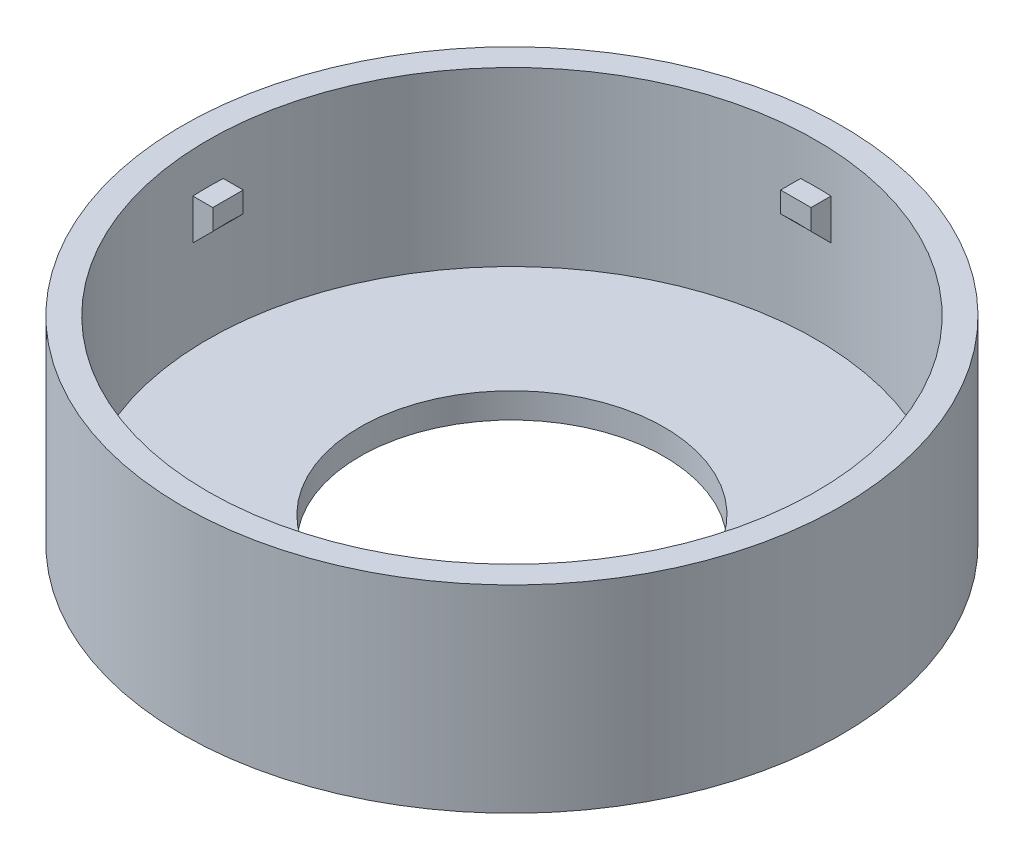
ISO-10303-21;
HEADER;
FILE_DESCRIPTION(('STEP AP214'),'2;1');
FILE_NAME('part.step','',(''),(''),'','','');
FILE_SCHEMA(('AUTOMOTIVE_DESIGN { 1 0 10303 214 1 1 1 1 }'));
ENDSEC;
DATA;
#1=APPLICATION_CONTEXT('core data for automotive mechanical design processes');
#2=APPLICATION_PROTOCOL_DEFINITION('international standard','automotive_design',2000,#1);
#3=PRODUCT_CONTEXT('',#1,'mechanical');
#4=PRODUCT('Part','Part','',(#3));
#5=PRODUCT_RELATED_PRODUCT_CATEGORY('part','',(#4));
#6=PRODUCT_DEFINITION_FORMATION('','',#4);
#7=PRODUCT_DEFINITION_CONTEXT('part definition',#1,'design');
#8=PRODUCT_DEFINITION('design','',#6,#7);
#9=PRODUCT_DEFINITION_SHAPE('','',#8);
#10=(LENGTH_UNIT() NAMED_UNIT(*) SI_UNIT(.MILLI.,.METRE.));
#11=(NAMED_UNIT(*) PLANE_ANGLE_UNIT() SI_UNIT($,.RADIAN.));
#12=(NAMED_UNIT(*) SI_UNIT($,.STERADIAN.) SOLID_ANGLE_UNIT());
#13=UNCERTAINTY_MEASURE_WITH_UNIT(LENGTH_MEASURE(1.E-05),#10,'distance_accuracy_value','');
#14=(GEOMETRIC_REPRESENTATION_CONTEXT(3) GLOBAL_UNCERTAINTY_ASSIGNED_CONTEXT((#13)) GLOBAL_UNIT_ASSIGNED_CONTEXT((#10,
#11,#12)) REPRESENTATION_CONTEXT('',''));
#15=CARTESIAN_POINT('',(0.,0.,0.));
#16=DIRECTION('',(0.,0.,1.));
#17=DIRECTION('',(1.,0.,0.));
#18=AXIS2_PLACEMENT_3D('',#15,#16,#17);
#19=CARTESIAN_POINT('',(0.,19.5,0.));
#20=DIRECTION('',(0.,-1.,0.));
#21=DIRECTION('',(0.,0.,-1.));
#22=AXIS2_PLACEMENT_3D('',#19,#20,#21);
#23=CYLINDRICAL_SURFACE('',#22,30.);
#24=CARTESIAN_POINT('',(0.,19.5,0.));
#25=DIRECTION('',(0.,1.,0.));
#26=DIRECTION('',(0.,0.,1.));
#27=AXIS2_PLACEMENT_3D('',#24,#25,#26);
#28=CIRCLE('',#27,30.);
#29=CARTESIAN_POINT('',(0.,19.5,30.));
#30=VERTEX_POINT('',#29);
#31=EDGE_CURVE('E257',#30,#30,#28,.T.);
#32=ORIENTED_EDGE('',*,*,#31,.T.);
#33=EDGE_LOOP('',(#32));
#34=FACE_BOUND('',#33,.T.);
#35=CARTESIAN_POINT('',(0.,2.5,0.));
#36=DIRECTION('',(0.,1.,0.));
#37=DIRECTION('',(0.,0.,1.));
#38=AXIS2_PLACEMENT_3D('',#35,#36,#37);
#39=CIRCLE('',#38,30.);
#40=CARTESIAN_POINT('',(0.,2.5,30.));
#41=VERTEX_POINT('',#40);
#42=EDGE_CURVE('E272',#41,#41,#39,.F.);
#43=ORIENTED_EDGE('',*,*,#42,.T.);
#44=EDGE_LOOP('',(#43));
#45=FACE_BOUND('',#44,.T.);
#46=CARTESIAN_POINT('',(0.,11.5,0.));
#47=DIRECTION('',(0.,1.,0.));
#48=DIRECTION('',(0.,0.,1.));
#49=AXIS2_PLACEMENT_3D('',#46,#47,#48);
#50=CIRCLE('',#49,30.);
#51=CARTESIAN_POINT('',(1.5,11.5,-29.9624765331573));
#52=VERTEX_POINT('',#51);
#53=CARTESIAN_POINT('',(-1.5,11.5,-29.9624765331573));
#54=VERTEX_POINT('',#53);
#55=EDGE_CURVE('E278',#52,#54,#50,.T.);
#56=ORIENTED_EDGE('',*,*,#55,.T.);
#57=DIRECTION('',(0.,1.,0.));
#58=VECTOR('',#57,1.);
#59=CARTESIAN_POINT('',(-1.5,13.5,-29.9624765331573));
#60=LINE('',#59,#58);
#61=CARTESIAN_POINT('',(-1.5,15.5,-29.9624765331573));
#62=VERTEX_POINT('',#61);
#63=EDGE_CURVE('E260',#54,#62,#60,.T.);
#64=ORIENTED_EDGE('',*,*,#63,.T.);
#65=CARTESIAN_POINT('',(0.,15.5,0.));
#66=DIRECTION('',(0.,1.,0.));
#67=DIRECTION('',(0.,0.,1.));
#68=AXIS2_PLACEMENT_3D('',#65,#66,#67);
#69=CIRCLE('',#68,30.);
#70=CARTESIAN_POINT('',(1.5,15.5,-29.9624765331573));
#71=VERTEX_POINT('',#70);
#72=EDGE_CURVE('E245',#71,#62,#69,.T.);
#73=ORIENTED_EDGE('',*,*,#72,.F.);
#74=DIRECTION('',(0.,1.,0.));
#75=VECTOR('',#74,1.);
#76=CARTESIAN_POINT('',(1.5,13.5,-29.9624765331573));
#77=LINE('',#76,#75);
#78=EDGE_CURVE('E254',#52,#71,#77,.T.);
#79=ORIENTED_EDGE('',*,*,#78,.F.);
#80=EDGE_LOOP('',(#56,#64,#73,#79));
#81=FACE_BOUND('',#80,.T.);
#82=CARTESIAN_POINT('',(0.,11.5,0.));
#83=DIRECTION('',(0.,1.,0.));
#84=DIRECTION('',(0.,0.,1.));
#85=AXIS2_PLACEMENT_3D('',#82,#83,#84);
#86=CIRCLE('',#85,30.);
#87=CARTESIAN_POINT('',(-29.9624765331573,11.5,-1.49999999999999));
#88=VERTEX_POINT('',#87);
#89=CARTESIAN_POINT('',(-29.9624765331573,11.5,1.50000000000001));
#90=VERTEX_POINT('',#89);
#91=EDGE_CURVE('E275',#88,#90,#86,.T.);
#92=ORIENTED_EDGE('',*,*,#91,.T.);
#93=DIRECTION('',(0.,1.,0.));
#94=VECTOR('',#93,1.);
#95=CARTESIAN_POINT('',(-29.9624765331573,13.5,1.50000000000001));
#96=LINE('',#95,#94);
#97=CARTESIAN_POINT('',(-29.9624765331573,15.5,1.50000000000001));
#98=VERTEX_POINT('',#97);
#99=EDGE_CURVE('E239',#90,#98,#96,.T.);
#100=ORIENTED_EDGE('',*,*,#99,.T.);
#101=CARTESIAN_POINT('',(0.,15.5,0.));
#102=DIRECTION('',(0.,1.,0.));
#103=DIRECTION('',(0.,0.,1.));
#104=AXIS2_PLACEMENT_3D('',#101,#102,#103);
#105=CIRCLE('',#104,30.);
#106=CARTESIAN_POINT('',(-29.9624765331573,15.5,-1.49999999999999));
#107=VERTEX_POINT('',#106);
#108=EDGE_CURVE('E226',#107,#98,#105,.T.);
#109=ORIENTED_EDGE('',*,*,#108,.F.);
#110=DIRECTION('',(0.,1.,0.));
#111=VECTOR('',#110,1.);
#112=CARTESIAN_POINT('',(-29.9624765331573,13.5,-1.49999999999999));
#113=LINE('',#112,#111);
#114=EDGE_CURVE('E235',#88,#107,#113,.T.);
#115=ORIENTED_EDGE('',*,*,#114,.F.);
#116=EDGE_LOOP('',(#92,#100,#109,#115));
#117=FACE_BOUND('',#116,.T.);
#118=CARTESIAN_POINT('',(0.,11.5,0.));
#119=DIRECTION('',(0.,1.,0.));
#120=DIRECTION('',(0.,0.,1.));
#121=AXIS2_PLACEMENT_3D('',#118,#119,#120);
#122=CIRCLE('',#121,30.);
#123=CARTESIAN_POINT('',(29.9624765331573,11.5,1.5));
#124=VERTEX_POINT('',#123);
#125=CARTESIAN_POINT('',(29.9624765331573,11.5,-1.5));
#126=VERTEX_POINT('',#125);
#127=EDGE_CURVE('E281',#124,#126,#122,.T.);
#128=ORIENTED_EDGE('',*,*,#127,.T.);
#129=DIRECTION('',(0.,1.,0.));
#130=VECTOR('',#129,1.);
#131=CARTESIAN_POINT('',(29.9624765331573,13.5,-1.5));
#132=LINE('',#131,#130);
#133=CARTESIAN_POINT('',(29.9624765331573,15.5,-1.5));
#134=VERTEX_POINT('',#133);
#135=EDGE_CURVE('E220',#126,#134,#132,.T.);
#136=ORIENTED_EDGE('',*,*,#135,.T.);
#137=CARTESIAN_POINT('',(0.,15.5,0.));
#138=DIRECTION('',(0.,1.,0.));
#139=DIRECTION('',(0.,0.,1.));
#140=AXIS2_PLACEMENT_3D('',#137,#138,#139);
#141=CIRCLE('',#140,30.);
#142=CARTESIAN_POINT('',(29.9624765331573,15.5,1.5));
#143=VERTEX_POINT('',#142);
#144=EDGE_CURVE('E205',#143,#134,#141,.T.);
#145=ORIENTED_EDGE('',*,*,#144,.F.);
#146=DIRECTION('',(0.,1.,0.));
#147=VECTOR('',#146,1.);
#148=CARTESIAN_POINT('',(29.9624765331573,13.5,1.5));
#149=LINE('',#148,#147);
#150=EDGE_CURVE('E214',#124,#143,#149,.T.);
#151=ORIENTED_EDGE('',*,*,#150,.F.);
#152=EDGE_LOOP('',(#128,#136,#145,#151));
#153=FACE_BOUND('',#152,.T.);
#154=CARTESIAN_POINT('',(0.,11.5,0.));
#155=DIRECTION('',(0.,1.,0.));
#156=DIRECTION('',(0.,0.,1.));
#157=AXIS2_PLACEMENT_3D('',#154,#155,#156);
#158=CIRCLE('',#157,30.);
#159=CARTESIAN_POINT('',(-1.5,11.5,29.9624765331573));
#160=VERTEX_POINT('',#159);
#161=CARTESIAN_POINT('',(1.5,11.5,29.9624765331573));
#162=VERTEX_POINT('',#161);
#163=EDGE_CURVE('E173',#160,#162,#158,.T.);
#164=ORIENTED_EDGE('',*,*,#163,.T.);
#165=DIRECTION('',(0.,1.,0.));
#166=VECTOR('',#165,1.);
#167=CARTESIAN_POINT('',(1.5,13.5,29.9624765331573));
#168=LINE('',#167,#166);
#169=CARTESIAN_POINT('',(1.5,15.5,29.9624765331573));
#170=VERTEX_POINT('',#169);
#171=EDGE_CURVE('E167',#162,#170,#168,.T.);
#172=ORIENTED_EDGE('',*,*,#171,.T.);
#173=CARTESIAN_POINT('',(0.,15.5,0.));
#174=DIRECTION('',(0.,1.,0.));
#175=DIRECTION('',(0.,0.,1.));
#176=AXIS2_PLACEMENT_3D('',#173,#174,#175);
#177=CIRCLE('',#176,30.);
#178=CARTESIAN_POINT('',(-1.5,15.5,29.9624765331573));
#179=VERTEX_POINT('',#178);
#180=EDGE_CURVE('E170',#179,#170,#177,.T.);
#181=ORIENTED_EDGE('',*,*,#180,.F.);
#182=DIRECTION('',(0.,1.,0.));
#183=VECTOR('',#182,1.);
#184=CARTESIAN_POINT('',(-1.5,13.5,29.9624765331573));
#185=LINE('',#184,#183);
#186=EDGE_CURVE('E178',#160,#179,#185,.T.);
#187=ORIENTED_EDGE('',*,*,#186,.F.);
#188=EDGE_LOOP('',(#164,#172,#181,#187));
#189=FACE_BOUND('',#188,.T.);
#190=ADVANCED_FACE('F36',(#34,#45,#81,#117,#153,#189),#23,.F.);
#191=CARTESIAN_POINT('',(0.,2.5,0.));
#192=DIRECTION('',(0.,-1.,0.));
#193=DIRECTION('',(0.,0.,-1.));
#194=AXIS2_PLACEMENT_3D('',#191,#192,#193);
#195=CYLINDRICAL_SURFACE('',#194,32.5);
#196=CARTESIAN_POINT('',(0.,0.,0.));
#197=DIRECTION('',(0.,1.,0.));
#198=DIRECTION('',(0.,0.,1.));
#199=AXIS2_PLACEMENT_3D('',#196,#197,#198);
#200=CIRCLE('',#199,32.5);
#201=CARTESIAN_POINT('',(0.,0.,32.5));
#202=VERTEX_POINT('',#201);
#203=EDGE_CURVE('E269',#202,#202,#200,.T.);
#204=ORIENTED_EDGE('',*,*,#203,.T.);
#205=EDGE_LOOP('',(#204));
#206=FACE_BOUND('',#205,.T.);
#207=CARTESIAN_POINT('',(0.,19.5,0.));
#208=DIRECTION('',(0.,1.,0.));
#209=DIRECTION('',(0.,0.,1.));
#210=AXIS2_PLACEMENT_3D('',#207,#208,#209);
#211=CIRCLE('',#210,32.5);
#212=CARTESIAN_POINT('',(0.,19.5,32.5));
#213=VERTEX_POINT('',#212);
#214=EDGE_CURVE('E266',#213,#213,#211,.T.);
#215=ORIENTED_EDGE('',*,*,#214,.F.);
#216=EDGE_LOOP('',(#215));
#217=FACE_BOUND('',#216,.T.);
#218=ADVANCED_FACE('F313',(#206,#217),#195,.T.);
#219=CARTESIAN_POINT('',(0.,0.,0.));
#220=DIRECTION('',(0.,1.,0.));
#221=DIRECTION('',(0.,0.,1.));
#222=AXIS2_PLACEMENT_3D('',#219,#220,#221);
#223=PLANE('',#222);
#224=CARTESIAN_POINT('',(0.,0.,0.));
#225=DIRECTION('',(0.,1.,0.));
#226=DIRECTION('',(0.,0.,1.));
#227=AXIS2_PLACEMENT_3D('',#224,#225,#226);
#228=CIRCLE('',#227,15.);
#229=CARTESIAN_POINT('',(0.,0.,15.));
#230=VERTEX_POINT('',#229);
#231=EDGE_CURVE('E193',#230,#230,#228,.T.);
#232=ORIENTED_EDGE('',*,*,#231,.T.);
#233=EDGE_LOOP('',(#232));
#234=FACE_BOUND('',#233,.T.);
#235=ORIENTED_EDGE('',*,*,#203,.F.);
#236=EDGE_LOOP('',(#235));
#237=FACE_BOUND('',#236,.T.);
#238=ADVANCED_FACE('F357',(#234,#237),#223,.F.);
#239=CARTESIAN_POINT('',(0.,19.5,0.));
#240=DIRECTION('',(0.,1.,0.));
#241=DIRECTION('',(0.,0.,1.));
#242=AXIS2_PLACEMENT_3D('',#239,#240,#241);
#243=PLANE('',#242);
#244=ORIENTED_EDGE('',*,*,#214,.T.);
#245=EDGE_LOOP('',(#244));
#246=FACE_BOUND('',#245,.T.);
#247=ORIENTED_EDGE('',*,*,#31,.F.);
#248=EDGE_LOOP('',(#247));
#249=FACE_BOUND('',#248,.T.);
#250=ADVANCED_FACE('F365',(#246,#249),#243,.T.);
#251=CARTESIAN_POINT('',(0.,2.5,0.));
#252=DIRECTION('',(0.,1.,0.));
#253=DIRECTION('',(0.,0.,1.));
#254=AXIS2_PLACEMENT_3D('',#251,#252,#253);
#255=PLANE('',#254);
#256=CARTESIAN_POINT('',(0.,2.5,0.));
#257=DIRECTION('',(0.,1.,0.));
#258=DIRECTION('',(0.,0.,1.));
#259=AXIS2_PLACEMENT_3D('',#256,#257,#258);
#260=CIRCLE('',#259,15.);
#261=CARTESIAN_POINT('',(0.,2.5,15.));
#262=VERTEX_POINT('',#261);
#263=EDGE_CURVE('E383',#262,#262,#260,.T.);
#264=ORIENTED_EDGE('',*,*,#263,.F.);
#265=EDGE_LOOP('',(#264));
#266=FACE_BOUND('',#265,.T.);
#267=ORIENTED_EDGE('',*,*,#42,.F.);
#268=EDGE_LOOP('',(#267));
#269=FACE_BOUND('',#268,.T.);
#270=ADVANCED_FACE('F368',(#266,#269),#255,.T.);
#271=CARTESIAN_POINT('',(1.5,13.5,0.));
#272=DIRECTION('',(1.,0.,0.));
#273=DIRECTION('',(0.,0.,-1.));
#274=AXIS2_PLACEMENT_3D('',#271,#272,#273);
#275=PLANE('',#274);
#276=DIRECTION('',(0.,0.,-1.));
#277=VECTOR('',#276,1.);
#278=CARTESIAN_POINT('',(1.5,15.5,0.));
#279=LINE('',#278,#277);
#280=CARTESIAN_POINT('',(1.5,15.5,-28.));
#281=VERTEX_POINT('',#280);
#282=EDGE_CURVE('E237',#281,#71,#279,.T.);
#283=ORIENTED_EDGE('',*,*,#282,.F.);
#284=DIRECTION('',(0.,1.,0.));
#285=VECTOR('',#284,1.);
#286=CARTESIAN_POINT('',(1.5,13.5,-28.));
#287=LINE('',#286,#285);
#288=CARTESIAN_POINT('',(1.5,13.4598502143801,-28.));
#289=VERTEX_POINT('',#288);
#290=EDGE_CURVE('E255',#289,#281,#287,.T.);
#291=ORIENTED_EDGE('',*,*,#290,.F.);
#292=CARTESIAN_POINT('',(1.5,13.4598502143801,-28.));
#293=CARTESIAN_POINT('',(1.5,13.1332233222363,-28.327094212637));
#294=CARTESIAN_POINT('',(1.5,12.8065890249633,-28.6541810300548));
#295=CARTESIAN_POINT('',(1.5,12.1533056201699,-29.3083398744405));
#296=CARTESIAN_POINT('',(1.5,11.8266565126496,-29.6354119014085));
#297=CARTESIAN_POINT('',(1.5,11.5,-29.9624765331573));
#298=B_SPLINE_CURVE_WITH_KNOTS('',3,(#292,#293,#294,#295,#296,#297),.UNSPECIFIED.,.F.,.F.,(4,2,
4),(0.,1.38675223185397,2.77350446365994),.UNSPECIFIED.);
#299=EDGE_CURVE('E477',#289,#52,#298,.T.);
#300=ORIENTED_EDGE('',*,*,#299,.T.);
#301=ORIENTED_EDGE('',*,*,#78,.T.);
#302=EDGE_LOOP('',(#283,#291,#300,#301));
#303=FACE_BOUND('',#302,.T.);
#304=ADVANCED_FACE('F362',(#303),#275,.T.);
#305=CARTESIAN_POINT('',(0.,13.5,-28.));
#306=DIRECTION('',(0.,0.,1.));
#307=DIRECTION('',(1.,0.,0.));
#308=AXIS2_PLACEMENT_3D('',#305,#306,#307);
#309=PLANE('',#308);
#310=DIRECTION('',(1.,0.,0.));
#311=VECTOR('',#310,1.);
#312=CARTESIAN_POINT('',(0.,15.5,-28.));
#313=LINE('',#312,#311);
#314=CARTESIAN_POINT('',(-1.5,15.5,-28.));
#315=VERTEX_POINT('',#314);
#316=EDGE_CURVE('E251',#315,#281,#313,.T.);
#317=ORIENTED_EDGE('',*,*,#316,.F.);
#318=DIRECTION('',(0.,1.,0.));
#319=VECTOR('',#318,1.);
#320=CARTESIAN_POINT('',(-1.5,13.5,-28.));
#321=LINE('',#320,#319);
#322=CARTESIAN_POINT('',(-1.5,13.4598502143801,-28.));
#323=VERTEX_POINT('',#322);
#324=EDGE_CURVE('E258',#323,#315,#321,.T.);
#325=ORIENTED_EDGE('',*,*,#324,.F.);
#326=CARTESIAN_POINT('',(-1.5,13.4598502143801,-28.));
#327=CARTESIAN_POINT('',(-1.25017891920671,13.4732250877001,-28.));
#328=CARTESIAN_POINT('',(-1.00026839482471,13.4832583398279,-28.));
#329=CARTESIAN_POINT('',(-0.500268394870513,13.4966416034125,-28.));
#330=CARTESIAN_POINT('',(-0.250178919252517,13.499991613158,-28.));
#331=CARTESIAN_POINT('',(0.,13.5,-28.));
#332=B_SPLINE_CURVE_WITH_KNOTS('',3,(#326,#327,#328,#329,#330,#331),.UNSPECIFIED.,.F.,.F.,(4,2,
4),(0.,0.750335543011481,1.50067127814717),.UNSPECIFIED.);
#333=CARTESIAN_POINT('',(0.,13.5,-28.));
#334=VERTEX_POINT('',#333);
#335=EDGE_CURVE('E452',#323,#334,#332,.T.);
#336=ORIENTED_EDGE('',*,*,#335,.T.);
#337=CARTESIAN_POINT('',(0.,13.5,-28.));
#338=CARTESIAN_POINT('',(0.250178919252516,13.499991613158,-28.));
#339=CARTESIAN_POINT('',(0.500268394870512,13.4966416034125,-28.));
#340=CARTESIAN_POINT('',(1.00026839482471,13.4832583398279,-28.));
#341=CARTESIAN_POINT('',(1.25017891920671,13.4732250877001,-28.));
#342=CARTESIAN_POINT('',(1.5,13.4598502143801,-28.));
#343=B_SPLINE_CURVE_WITH_KNOTS('',3,(#337,#338,#339,#340,#341,#342),.UNSPECIFIED.,.F.,.F.,(4,2,
4),(0.,0.750335735135687,1.50067127814717),.UNSPECIFIED.);
#344=EDGE_CURVE('E471',#334,#289,#343,.T.);
#345=ORIENTED_EDGE('',*,*,#344,.T.);
#346=ORIENTED_EDGE('',*,*,#290,.T.);
#347=EDGE_LOOP('',(#317,#325,#336,#345,#346));
#348=FACE_BOUND('',#347,.T.);
#349=ADVANCED_FACE('F483',(#348),#309,.T.);
#350=CARTESIAN_POINT('',(-1.5,13.5,0.));
#351=DIRECTION('',(1.,0.,0.));
#352=DIRECTION('',(0.,0.,-1.));
#353=AXIS2_PLACEMENT_3D('',#350,#351,#352);
#354=PLANE('',#353);
#355=DIRECTION('',(0.,0.,-1.));
#356=VECTOR('',#355,1.);
#357=CARTESIAN_POINT('',(-1.5,15.5,0.));
#358=LINE('',#357,#356);
#359=EDGE_CURVE('E248',#315,#62,#358,.T.);
#360=ORIENTED_EDGE('',*,*,#359,.T.);
#361=ORIENTED_EDGE('',*,*,#63,.F.);
#362=CARTESIAN_POINT('',(-1.5,11.5,-29.9624765331573));
#363=CARTESIAN_POINT('',(-1.5,11.8266565126496,-29.6354119014085));
#364=CARTESIAN_POINT('',(-1.5,12.1533056201699,-29.3083398744405));
#365=CARTESIAN_POINT('',(-1.5,12.8065890249633,-28.6541810300548));
#366=CARTESIAN_POINT('',(-1.5,13.1332233222363,-28.327094212637));
#367=CARTESIAN_POINT('',(-1.5,13.4598502143801,-28.));
#368=B_SPLINE_CURVE_WITH_KNOTS('',3,(#362,#363,#364,#365,#366,#367),.UNSPECIFIED.,.F.,.F.,(4,2,
4),(0.,1.38675223180597,2.77350446365994),.UNSPECIFIED.);
#369=EDGE_CURVE('E441',#54,#323,#368,.T.);
#370=ORIENTED_EDGE('',*,*,#369,.T.);
#371=ORIENTED_EDGE('',*,*,#324,.T.);
#372=EDGE_LOOP('',(#360,#361,#370,#371));
#373=FACE_BOUND('',#372,.T.);
#374=ADVANCED_FACE('F459',(#373),#354,.F.);
#375=CARTESIAN_POINT('',(0.,15.5,0.));
#376=DIRECTION('',(0.,1.,0.));
#377=DIRECTION('',(0.,0.,1.));
#378=AXIS2_PLACEMENT_3D('',#375,#376,#377);
#379=PLANE('',#378);
#380=ORIENTED_EDGE('',*,*,#282,.T.);
#381=ORIENTED_EDGE('',*,*,#72,.T.);
#382=ORIENTED_EDGE('',*,*,#359,.F.);
#383=ORIENTED_EDGE('',*,*,#316,.T.);
#384=EDGE_LOOP('',(#380,#381,#382,#383));
#385=FACE_BOUND('',#384,.T.);
#386=ADVANCED_FACE('F488',(#385),#379,.T.);
#387=CARTESIAN_POINT('',(0.,13.5,-1.5));
#388=DIRECTION('',(0.,0.,-1.));
#389=DIRECTION('',(-1.,0.,0.));
#390=AXIS2_PLACEMENT_3D('',#387,#388,#389);
#391=PLANE('',#390);
#392=DIRECTION('',(-1.,0.,0.));
#393=VECTOR('',#392,1.);
#394=CARTESIAN_POINT('',(0.,15.5,-1.5));
#395=LINE('',#394,#393);
#396=CARTESIAN_POINT('',(-28.,15.5,-1.5));
#397=VERTEX_POINT('',#396);
#398=EDGE_CURVE('E217',#397,#107,#395,.T.);
#399=ORIENTED_EDGE('',*,*,#398,.F.);
#400=DIRECTION('',(0.,1.,0.));
#401=VECTOR('',#400,1.);
#402=CARTESIAN_POINT('',(-28.,13.5,-1.5));
#403=LINE('',#402,#401);
#404=CARTESIAN_POINT('',(-28.,13.4598502143801,-1.5));
#405=VERTEX_POINT('',#404);
#406=EDGE_CURVE('E57',#405,#397,#403,.T.);
#407=ORIENTED_EDGE('',*,*,#406,.F.);
#408=CARTESIAN_POINT('',(-28.,13.4598502143801,-1.5));
#409=CARTESIAN_POINT('',(-28.327094212637,13.1332233222363,-1.5));
#410=CARTESIAN_POINT('',(-28.6541810300548,12.8065890249633,-1.49999999999999));
#411=CARTESIAN_POINT('',(-29.3083398744405,12.1533056201699,-1.49999999999999));
#412=CARTESIAN_POINT('',(-29.6354119014085,11.8266565126496,-1.49999999999999));
#413=CARTESIAN_POINT('',(-29.9624765331573,11.5,-1.49999999999999));
#414=B_SPLINE_CURVE_WITH_KNOTS('',3,(#408,#409,#410,#411,#412,#413),.UNSPECIFIED.,.F.,.F.,(4,2,
4),(0.,1.38675223185397,2.77350446365994),.UNSPECIFIED.);
#415=EDGE_CURVE('E11',#405,#88,#414,.T.);
#416=ORIENTED_EDGE('',*,*,#415,.T.);
#417=ORIENTED_EDGE('',*,*,#114,.T.);
#418=EDGE_LOOP('',(#399,#407,#416,#417));
#419=FACE_BOUND('',#418,.T.);
#420=ADVANCED_FACE('F491',(#419),#391,.T.);
#421=CARTESIAN_POINT('',(-28.,13.5,0.));
#422=DIRECTION('',(1.,0.,0.));
#423=DIRECTION('',(0.,0.,-1.));
#424=AXIS2_PLACEMENT_3D('',#421,#422,#423);
#425=PLANE('',#424);
#426=DIRECTION('',(0.,0.,-1.));
#427=VECTOR('',#426,1.);
#428=CARTESIAN_POINT('',(-28.,15.5,0.));
#429=LINE('',#428,#427);
#430=CARTESIAN_POINT('',(-28.,15.5,1.50000000000001));
#431=VERTEX_POINT('',#430);
#432=EDGE_CURVE('E232',#431,#397,#429,.T.);
#433=ORIENTED_EDGE('',*,*,#432,.F.);
#434=DIRECTION('',(0.,1.,0.));
#435=VECTOR('',#434,1.);
#436=CARTESIAN_POINT('',(-28.,13.5,1.50000000000001));
#437=LINE('',#436,#435);
#438=CARTESIAN_POINT('',(-28.,13.4598502143801,1.50000000000001));
#439=VERTEX_POINT('',#438);
#440=EDGE_CURVE('E65',#439,#431,#437,.T.);
#441=ORIENTED_EDGE('',*,*,#440,.F.);
#442=CARTESIAN_POINT('',(-28.,13.4598502143801,1.50000000000001));
#443=CARTESIAN_POINT('',(-28.,13.4732250877001,1.25017891920672));
#444=CARTESIAN_POINT('',(-28.,13.4832583398279,1.00026839482471));
#445=CARTESIAN_POINT('',(-28.,13.4966416034125,0.500268394870515));
#446=CARTESIAN_POINT('',(-28.,13.499991613158,0.250178919252518));
#447=CARTESIAN_POINT('',(-28.,13.5,0.));
#448=B_SPLINE_CURVE_WITH_KNOTS('',3,(#442,#443,#444,#445,#446,#447),.UNSPECIFIED.,.F.,.F.,(4,2,
4),(0.,0.750335543011483,1.50067127814717),.UNSPECIFIED.);
#449=CARTESIAN_POINT('',(-28.,13.5,0.));
#450=VERTEX_POINT('',#449);
#451=EDGE_CURVE('E508',#439,#450,#448,.T.);
#452=ORIENTED_EDGE('',*,*,#451,.T.);
#453=CARTESIAN_POINT('',(-28.,13.5,0.));
#454=CARTESIAN_POINT('',(-28.,13.499991613158,-0.250178919252516));
#455=CARTESIAN_POINT('',(-28.,13.4966416034125,-0.500268394870511));
#456=CARTESIAN_POINT('',(-28.,13.4832583398279,-1.0002683948247));
#457=CARTESIAN_POINT('',(-28.,13.4732250877001,-1.25017891920671));
#458=CARTESIAN_POINT('',(-28.,13.4598502143801,-1.5));
#459=B_SPLINE_CURVE_WITH_KNOTS('',3,(#453,#454,#455,#456,#457,#458),.UNSPECIFIED.,.F.,.F.,(4,2,
4),(0.,0.750335735135685,1.50067127814716),.UNSPECIFIED.);
#460=EDGE_CURVE('E51',#450,#405,#459,.T.);
#461=ORIENTED_EDGE('',*,*,#460,.T.);
#462=ORIENTED_EDGE('',*,*,#406,.T.);
#463=EDGE_LOOP('',(#433,#441,#452,#461,#462));
#464=FACE_BOUND('',#463,.T.);
#465=ADVANCED_FACE('F496',(#464),#425,.T.);
#466=CARTESIAN_POINT('',(0.,13.5,1.5));
#467=DIRECTION('',(0.,0.,-1.));
#468=DIRECTION('',(-1.,0.,0.));
#469=AXIS2_PLACEMENT_3D('',#466,#467,#468);
#470=PLANE('',#469);
#471=DIRECTION('',(-1.,0.,0.));
#472=VECTOR('',#471,1.);
#473=CARTESIAN_POINT('',(0.,15.5,1.5));
#474=LINE('',#473,#472);
#475=EDGE_CURVE('E229',#431,#98,#474,.T.);
#476=ORIENTED_EDGE('',*,*,#475,.T.);
#477=ORIENTED_EDGE('',*,*,#99,.F.);
#478=CARTESIAN_POINT('',(-29.9624765331573,11.5,1.50000000000001));
#479=CARTESIAN_POINT('',(-29.6354119014085,11.8266565126496,1.50000000000001));
#480=CARTESIAN_POINT('',(-29.3083398744405,12.1533056201699,1.50000000000001));
#481=CARTESIAN_POINT('',(-28.6541810300548,12.8065890249633,1.50000000000001));
#482=CARTESIAN_POINT('',(-28.327094212637,13.1332233222363,1.50000000000001));
#483=CARTESIAN_POINT('',(-28.,13.4598502143801,1.50000000000001));
#484=B_SPLINE_CURVE_WITH_KNOTS('',3,(#478,#479,#480,#481,#482,#483),.UNSPECIFIED.,.F.,.F.,(4,2,
4),(0.,1.38675223180597,2.77350446365994),.UNSPECIFIED.);
#485=EDGE_CURVE('E502',#90,#439,#484,.T.);
#486=ORIENTED_EDGE('',*,*,#485,.T.);
#487=ORIENTED_EDGE('',*,*,#440,.T.);
#488=EDGE_LOOP('',(#476,#477,#486,#487));
#489=FACE_BOUND('',#488,.T.);
#490=ADVANCED_FACE('F497',(#489),#470,.F.);
#491=CARTESIAN_POINT('',(0.,15.5,0.));
#492=DIRECTION('',(0.,1.,0.));
#493=DIRECTION('',(0.,0.,1.));
#494=AXIS2_PLACEMENT_3D('',#491,#492,#493);
#495=PLANE('',#494);
#496=ORIENTED_EDGE('',*,*,#398,.T.);
#497=ORIENTED_EDGE('',*,*,#108,.T.);
#498=ORIENTED_EDGE('',*,*,#475,.F.);
#499=ORIENTED_EDGE('',*,*,#432,.T.);
#500=EDGE_LOOP('',(#496,#497,#498,#499));
#501=FACE_BOUND('',#500,.T.);
#502=ADVANCED_FACE('F432',(#501),#495,.T.);
#503=CARTESIAN_POINT('',(0.,13.5,1.5));
#504=DIRECTION('',(0.,0.,1.));
#505=DIRECTION('',(1.,0.,0.));
#506=AXIS2_PLACEMENT_3D('',#503,#504,#505);
#507=PLANE('',#506);
#508=DIRECTION('',(1.,0.,0.));
#509=VECTOR('',#508,1.);
#510=CARTESIAN_POINT('',(0.,15.5,1.5));
#511=LINE('',#510,#509);
#512=CARTESIAN_POINT('',(28.,15.5,1.5));
#513=VERTEX_POINT('',#512);
#514=EDGE_CURVE('E200',#513,#143,#511,.T.);
#515=ORIENTED_EDGE('',*,*,#514,.F.);
#516=DIRECTION('',(0.,1.,0.));
#517=VECTOR('',#516,1.);
#518=CARTESIAN_POINT('',(28.,13.5,1.5));
#519=LINE('',#518,#517);
#520=CARTESIAN_POINT('',(28.,13.4598502143801,1.5));
#521=VERTEX_POINT('',#520);
#522=EDGE_CURVE('E215',#521,#513,#519,.T.);
#523=ORIENTED_EDGE('',*,*,#522,.F.);
#524=CARTESIAN_POINT('',(28.,13.4598502143801,1.5));
#525=CARTESIAN_POINT('',(28.327094212637,13.1332233222363,1.5));
#526=CARTESIAN_POINT('',(28.6541810300548,12.8065890249633,1.5));
#527=CARTESIAN_POINT('',(29.3083398744405,12.1533056201699,1.5));
#528=CARTESIAN_POINT('',(29.6354119014085,11.8266565126496,1.5));
#529=CARTESIAN_POINT('',(29.9624765331573,11.5,1.5));
#530=B_SPLINE_CURVE_WITH_KNOTS('',3,(#524,#525,#526,#527,#528,#529),.UNSPECIFIED.,.F.,.F.,(4,2,
4),(0.,1.38675223185397,2.77350446365994),.UNSPECIFIED.);
#531=EDGE_CURVE('E400',#521,#124,#530,.T.);
#532=ORIENTED_EDGE('',*,*,#531,.T.);
#533=ORIENTED_EDGE('',*,*,#150,.T.);
#534=EDGE_LOOP('',(#515,#523,#532,#533));
#535=FACE_BOUND('',#534,.T.);
#536=ADVANCED_FACE('F428',(#535),#507,.T.);
#537=CARTESIAN_POINT('',(28.,13.5,0.));
#538=DIRECTION('',(-1.,0.,0.));
#539=DIRECTION('',(0.,0.,1.));
#540=AXIS2_PLACEMENT_3D('',#537,#538,#539);
#541=PLANE('',#540);
#542=DIRECTION('',(0.,0.,1.));
#543=VECTOR('',#542,1.);
#544=CARTESIAN_POINT('',(28.,15.5,0.));
#545=LINE('',#544,#543);
#546=CARTESIAN_POINT('',(28.,15.5,-1.5));
#547=VERTEX_POINT('',#546);
#548=EDGE_CURVE('E211',#547,#513,#545,.T.);
#549=ORIENTED_EDGE('',*,*,#548,.F.);
#550=DIRECTION('',(0.,1.,0.));
#551=VECTOR('',#550,1.);
#552=CARTESIAN_POINT('',(28.,13.5,-1.5));
#553=LINE('',#552,#551);
#554=CARTESIAN_POINT('',(28.,13.4598502143801,-1.5));
#555=VERTEX_POINT('',#554);
#556=EDGE_CURVE('E218',#555,#547,#553,.T.);
#557=ORIENTED_EDGE('',*,*,#556,.F.);
#558=CARTESIAN_POINT('',(28.,13.4598502143801,-1.5));
#559=CARTESIAN_POINT('',(28.,13.4732250877001,-1.25017891920671));
#560=CARTESIAN_POINT('',(28.,13.4832583398279,-1.00026839482471));
#561=CARTESIAN_POINT('',(28.,13.4966416034125,-0.500268394870513));
#562=CARTESIAN_POINT('',(28.,13.499991613158,-0.250178919252518));
#563=CARTESIAN_POINT('',(28.,13.5,0.));
#564=B_SPLINE_CURVE_WITH_KNOTS('',3,(#558,#559,#560,#561,#562,#563),.UNSPECIFIED.,.F.,.F.,(4,2,
4),(0.,0.750335543011481,1.50067127814717),.UNSPECIFIED.);
#565=CARTESIAN_POINT('',(28.,13.5,0.));
#566=VERTEX_POINT('',#565);
#567=EDGE_CURVE('E404',#555,#566,#564,.T.);
#568=ORIENTED_EDGE('',*,*,#567,.T.);
#569=CARTESIAN_POINT('',(28.,13.5,0.));
#570=CARTESIAN_POINT('',(28.,13.499991613158,0.250178919252516));
#571=CARTESIAN_POINT('',(28.,13.4966416034125,0.500268394870512));
#572=CARTESIAN_POINT('',(28.,13.4832583398279,1.00026839482471));
#573=CARTESIAN_POINT('',(28.,13.4732250877001,1.25017891920671));
#574=CARTESIAN_POINT('',(28.,13.4598502143801,1.5));
#575=B_SPLINE_CURVE_WITH_KNOTS('',3,(#569,#570,#571,#572,#573,#574),.UNSPECIFIED.,.F.,.F.,(4,2,
4),(0.,0.750335735135686,1.50067127814717),.UNSPECIFIED.);
#576=EDGE_CURVE('E406',#566,#521,#575,.T.);
#577=ORIENTED_EDGE('',*,*,#576,.T.);
#578=ORIENTED_EDGE('',*,*,#522,.T.);
#579=EDGE_LOOP('',(#549,#557,#568,#577,#578));
#580=FACE_BOUND('',#579,.T.);
#581=ADVANCED_FACE('F425',(#580),#541,.T.);
#582=CARTESIAN_POINT('',(0.,13.5,-1.5));
#583=DIRECTION('',(0.,0.,1.));
#584=DIRECTION('',(1.,0.,0.));
#585=AXIS2_PLACEMENT_3D('',#582,#583,#584);
#586=PLANE('',#585);
#587=DIRECTION('',(1.,0.,0.));
#588=VECTOR('',#587,1.);
#589=CARTESIAN_POINT('',(0.,15.5,-1.5));
#590=LINE('',#589,#588);
#591=EDGE_CURVE('E208',#547,#134,#590,.T.);
#592=ORIENTED_EDGE('',*,*,#591,.T.);
#593=ORIENTED_EDGE('',*,*,#135,.F.);
#594=CARTESIAN_POINT('',(29.9624765331573,11.5,-1.5));
#595=CARTESIAN_POINT('',(29.6354119014085,11.8266565126496,-1.5));
#596=CARTESIAN_POINT('',(29.3083398744405,12.1533056201699,-1.5));
#597=CARTESIAN_POINT('',(28.6541810300548,12.8065890249633,-1.5));
#598=CARTESIAN_POINT('',(28.327094212637,13.1332233222363,-1.5));
#599=CARTESIAN_POINT('',(28.,13.4598502143801,-1.5));
#600=B_SPLINE_CURVE_WITH_KNOTS('',3,(#594,#595,#596,#597,#598,#599),.UNSPECIFIED.,.F.,.F.,(4,2,
4),(0.,1.38675223180597,2.77350446365994),.UNSPECIFIED.);
#601=EDGE_CURVE('E403',#126,#555,#600,.T.);
#602=ORIENTED_EDGE('',*,*,#601,.T.);
#603=ORIENTED_EDGE('',*,*,#556,.T.);
#604=EDGE_LOOP('',(#592,#593,#602,#603));
#605=FACE_BOUND('',#604,.T.);
#606=ADVANCED_FACE('F420',(#605),#586,.F.);
#607=CARTESIAN_POINT('',(0.,15.5,0.));
#608=DIRECTION('',(0.,1.,0.));
#609=DIRECTION('',(0.,0.,1.));
#610=AXIS2_PLACEMENT_3D('',#607,#608,#609);
#611=PLANE('',#610);
#612=ORIENTED_EDGE('',*,*,#514,.T.);
#613=ORIENTED_EDGE('',*,*,#144,.T.);
#614=ORIENTED_EDGE('',*,*,#591,.F.);
#615=ORIENTED_EDGE('',*,*,#548,.T.);
#616=EDGE_LOOP('',(#612,#613,#614,#615));
#617=FACE_BOUND('',#616,.T.);
#618=ADVANCED_FACE('F424',(#617),#611,.T.);
#619=CARTESIAN_POINT('',(-1.5,13.5,0.));
#620=DIRECTION('',(-1.,0.,0.));
#621=DIRECTION('',(0.,0.,1.));
#622=AXIS2_PLACEMENT_3D('',#619,#620,#621);
#623=PLANE('',#622);
#624=DIRECTION('',(0.,0.,1.));
#625=VECTOR('',#624,1.);
#626=CARTESIAN_POINT('',(-1.5,15.5,0.));
#627=LINE('',#626,#625);
#628=CARTESIAN_POINT('',(-1.5,15.5,28.));
#629=VERTEX_POINT('',#628);
#630=EDGE_CURVE('E191',#629,#179,#627,.T.);
#631=ORIENTED_EDGE('',*,*,#630,.F.);
#632=DIRECTION('',(0.,1.,0.));
#633=VECTOR('',#632,1.);
#634=CARTESIAN_POINT('',(-1.5,13.5,28.));
#635=LINE('',#634,#633);
#636=CARTESIAN_POINT('',(-1.5,13.4598502143801,28.));
#637=VERTEX_POINT('',#636);
#638=EDGE_CURVE('E198',#637,#629,#635,.T.);
#639=ORIENTED_EDGE('',*,*,#638,.F.);
#640=CARTESIAN_POINT('',(-1.5,13.4598502143801,28.));
#641=CARTESIAN_POINT('',(-1.5,13.1332233222363,28.327094212637));
#642=CARTESIAN_POINT('',(-1.5,12.8065890249633,28.6541810300548));
#643=CARTESIAN_POINT('',(-1.5,12.1533056201699,29.3083398744405));
#644=CARTESIAN_POINT('',(-1.5,11.8266565126496,29.6354119014085));
#645=CARTESIAN_POINT('',(-1.5,11.5,29.9624765331573));
#646=B_SPLINE_CURVE_WITH_KNOTS('',3,(#640,#641,#642,#643,#644,#645),.UNSPECIFIED.,.F.,.F.,(4,2,
4),(0.,1.38675223185397,2.77350446365994),.UNSPECIFIED.);
#647=EDGE_CURVE('E326',#637,#160,#646,.T.);
#648=ORIENTED_EDGE('',*,*,#647,.T.);
#649=ORIENTED_EDGE('',*,*,#186,.T.);
#650=EDGE_LOOP('',(#631,#639,#648,#649));
#651=FACE_BOUND('',#650,.T.);
#652=ADVANCED_FACE('F336',(#651),#623,.T.);
#653=CARTESIAN_POINT('',(0.,13.5,28.));
#654=DIRECTION('',(0.,0.,-1.));
#655=DIRECTION('',(-1.,0.,0.));
#656=AXIS2_PLACEMENT_3D('',#653,#654,#655);
#657=PLANE('',#656);
#658=DIRECTION('',(-1.,0.,0.));
#659=VECTOR('',#658,1.);
#660=CARTESIAN_POINT('',(0.,15.5,28.));
#661=LINE('',#660,#659);
#662=CARTESIAN_POINT('',(1.5,15.5,28.));
#663=VERTEX_POINT('',#662);
#664=EDGE_CURVE('E186',#663,#629,#661,.T.);
#665=ORIENTED_EDGE('',*,*,#664,.F.);
#666=DIRECTION('',(0.,1.,0.));
#667=VECTOR('',#666,1.);
#668=CARTESIAN_POINT('',(1.5,13.5,28.));
#669=LINE('',#668,#667);
#670=CARTESIAN_POINT('',(1.5,13.4598502143801,28.));
#671=VERTEX_POINT('',#670);
#672=EDGE_CURVE('E177',#671,#663,#669,.T.);
#673=ORIENTED_EDGE('',*,*,#672,.F.);
#674=CARTESIAN_POINT('',(1.5,13.4598502143801,28.));
#675=CARTESIAN_POINT('',(1.25017891920672,13.4732250877001,28.));
#676=CARTESIAN_POINT('',(1.00026839482471,13.4832583398279,28.));
#677=CARTESIAN_POINT('',(0.500268394870514,13.4966416034125,28.));
#678=CARTESIAN_POINT('',(0.250178919252518,13.499991613158,28.));
#679=CARTESIAN_POINT('',(0.,13.5,28.));
#680=B_SPLINE_CURVE_WITH_KNOTS('',3,(#674,#675,#676,#677,#678,#679),.UNSPECIFIED.,.F.,.F.,(4,2,
4),(0.,0.750335543011482,1.50067127814717),.UNSPECIFIED.);
#681=CARTESIAN_POINT('',(0.,13.5,28.));
#682=VERTEX_POINT('',#681);
#683=EDGE_CURVE('E293',#671,#682,#680,.T.);
#684=ORIENTED_EDGE('',*,*,#683,.T.);
#685=CARTESIAN_POINT('',(0.,13.5,28.));
#686=CARTESIAN_POINT('',(-0.250178919252516,13.499991613158,28.));
#687=CARTESIAN_POINT('',(-0.500268394870511,13.4966416034125,28.));
#688=CARTESIAN_POINT('',(-1.00026839482471,13.4832583398279,28.));
#689=CARTESIAN_POINT('',(-1.25017891920671,13.4732250877001,28.));
#690=CARTESIAN_POINT('',(-1.5,13.4598502143801,28.));
#691=B_SPLINE_CURVE_WITH_KNOTS('',3,(#685,#686,#687,#688,#689,#690),.UNSPECIFIED.,.F.,.F.,(4,2,
4),(0.,0.750335735135685,1.50067127814716),.UNSPECIFIED.);
#692=EDGE_CURVE('E320',#682,#637,#691,.T.);
#693=ORIENTED_EDGE('',*,*,#692,.T.);
#694=ORIENTED_EDGE('',*,*,#638,.T.);
#695=EDGE_LOOP('',(#665,#673,#684,#693,#694));
#696=FACE_BOUND('',#695,.T.);
#697=ADVANCED_FACE('F332',(#696),#657,.T.);
#698=CARTESIAN_POINT('',(1.5,13.5,0.));
#699=DIRECTION('',(-1.,0.,0.));
#700=DIRECTION('',(0.,0.,1.));
#701=AXIS2_PLACEMENT_3D('',#698,#699,#700);
#702=PLANE('',#701);
#703=DIRECTION('',(0.,0.,1.));
#704=VECTOR('',#703,1.);
#705=CARTESIAN_POINT('',(1.5,15.5,0.));
#706=LINE('',#705,#704);
#707=EDGE_CURVE('E181',#663,#170,#706,.T.);
#708=ORIENTED_EDGE('',*,*,#707,.T.);
#709=ORIENTED_EDGE('',*,*,#171,.F.);
#710=CARTESIAN_POINT('',(1.5,11.5,29.9624765331573));
#711=CARTESIAN_POINT('',(1.5,11.8266565126496,29.6354119014085));
#712=CARTESIAN_POINT('',(1.5,12.1533056201699,29.3083398744405));
#713=CARTESIAN_POINT('',(1.5,12.8065890249633,28.6541810300548));
#714=CARTESIAN_POINT('',(1.5,13.1332233222363,28.327094212637));
#715=CARTESIAN_POINT('',(1.5,13.4598502143801,28.));
#716=B_SPLINE_CURVE_WITH_KNOTS('',3,(#710,#711,#712,#713,#714,#715),.UNSPECIFIED.,.F.,.F.,(4,2,
4),(0.,1.38675223180597,2.77350446365994),.UNSPECIFIED.);
#717=EDGE_CURVE('E285',#162,#671,#716,.T.);
#718=ORIENTED_EDGE('',*,*,#717,.T.);
#719=ORIENTED_EDGE('',*,*,#672,.T.);
#720=EDGE_LOOP('',(#708,#709,#718,#719));
#721=FACE_BOUND('',#720,.T.);
#722=ADVANCED_FACE('F182',(#721),#702,.F.);
#723=CARTESIAN_POINT('',(0.,15.5,0.));
#724=DIRECTION('',(0.,1.,0.));
#725=DIRECTION('',(0.,0.,1.));
#726=AXIS2_PLACEMENT_3D('',#723,#724,#725);
#727=PLANE('',#726);
#728=ORIENTED_EDGE('',*,*,#630,.T.);
#729=ORIENTED_EDGE('',*,*,#180,.T.);
#730=ORIENTED_EDGE('',*,*,#707,.F.);
#731=ORIENTED_EDGE('',*,*,#664,.T.);
#732=EDGE_LOOP('',(#728,#729,#730,#731));
#733=FACE_BOUND('',#732,.T.);
#734=ADVANCED_FACE('F189',(#733),#727,.T.);
#735=CARTESIAN_POINT('',(0.,11.5,0.));
#736=DIRECTION('',(0.,-1.,0.));
#737=DIRECTION('',(0.,0.,-1.));
#738=AXIS2_PLACEMENT_3D('',#735,#736,#737);
#739=CONICAL_SURFACE('',#738,30.,0.785398163397445);
#740=ORIENTED_EDGE('',*,*,#647,.F.);
#741=ORIENTED_EDGE('',*,*,#692,.F.);
#742=ORIENTED_EDGE('',*,*,#683,.F.);
#743=ORIENTED_EDGE('',*,*,#717,.F.);
#744=ORIENTED_EDGE('',*,*,#163,.F.);
#745=EDGE_LOOP('',(#740,#741,#742,#743,#744));
#746=FACE_BOUND('',#745,.T.);
#747=ADVANCED_FACE('F303',(#746),#739,.F.);
#748=CARTESIAN_POINT('',(0.,11.5,0.));
#749=DIRECTION('',(0.,-1.,0.));
#750=DIRECTION('',(0.,0.,-1.));
#751=AXIS2_PLACEMENT_3D('',#748,#749,#750);
#752=CONICAL_SURFACE('',#751,30.,0.785398163397445);
#753=ORIENTED_EDGE('',*,*,#531,.F.);
#754=ORIENTED_EDGE('',*,*,#576,.F.);
#755=ORIENTED_EDGE('',*,*,#567,.F.);
#756=ORIENTED_EDGE('',*,*,#601,.F.);
#757=ORIENTED_EDGE('',*,*,#127,.F.);
#758=EDGE_LOOP('',(#753,#754,#755,#756,#757));
#759=FACE_BOUND('',#758,.T.);
#760=ADVANCED_FACE('F311',(#759),#752,.F.);
#761=CARTESIAN_POINT('',(0.,11.5,0.));
#762=DIRECTION('',(0.,-1.,0.));
#763=DIRECTION('',(0.,0.,-1.));
#764=AXIS2_PLACEMENT_3D('',#761,#762,#763);
#765=CONICAL_SURFACE('',#764,30.,0.785398163397445);
#766=ORIENTED_EDGE('',*,*,#299,.F.);
#767=ORIENTED_EDGE('',*,*,#344,.F.);
#768=ORIENTED_EDGE('',*,*,#335,.F.);
#769=ORIENTED_EDGE('',*,*,#369,.F.);
#770=ORIENTED_EDGE('',*,*,#55,.F.);
#771=EDGE_LOOP('',(#766,#767,#768,#769,#770));
#772=FACE_BOUND('',#771,.T.);
#773=ADVANCED_FACE('F347',(#772),#765,.F.);
#774=CARTESIAN_POINT('',(0.,11.5,0.));
#775=DIRECTION('',(0.,-1.,0.));
#776=DIRECTION('',(0.,0.,-1.));
#777=AXIS2_PLACEMENT_3D('',#774,#775,#776);
#778=CONICAL_SURFACE('',#777,30.,0.785398163397445);
#779=ORIENTED_EDGE('',*,*,#415,.F.);
#780=ORIENTED_EDGE('',*,*,#460,.F.);
#781=ORIENTED_EDGE('',*,*,#451,.F.);
#782=ORIENTED_EDGE('',*,*,#485,.F.);
#783=ORIENTED_EDGE('',*,*,#91,.F.);
#784=EDGE_LOOP('',(#779,#780,#781,#782,#783));
#785=FACE_BOUND('',#784,.T.);
#786=ADVANCED_FACE('F39',(#785),#778,.F.);
#787=CARTESIAN_POINT('',(0.,0.,0.));
#788=DIRECTION('',(0.,1.,0.));
#789=DIRECTION('',(0.,0.,1.));
#790=AXIS2_PLACEMENT_3D('',#787,#788,#789);
#791=CYLINDRICAL_SURFACE('',#790,15.);
#792=ORIENTED_EDGE('',*,*,#231,.F.);
#793=EDGE_LOOP('',(#792));
#794=FACE_BOUND('',#793,.T.);
#795=ORIENTED_EDGE('',*,*,#263,.T.);
#796=EDGE_LOOP('',(#795));
#797=FACE_BOUND('',#796,.T.);
#798=ADVANCED_FACE('F341',(#794,#797),#791,.F.);
#799=CLOSED_SHELL('',(#190,#218,#238,#250,#270,#304,#349,#374,#386,#420,#465,#490,#502,#536,
#581,#606,#618,#652,#697,#722,#734,#747,#760,#773,#786,#798));
#800=MANIFOLD_SOLID_BREP('B2',#799);
#801=ADVANCED_BREP_SHAPE_REPRESENTATION('',(#18,#800),#14);
#802=SHAPE_DEFINITION_REPRESENTATION(#9,#801);
ENDSEC;
END-ISO-10303-21;
